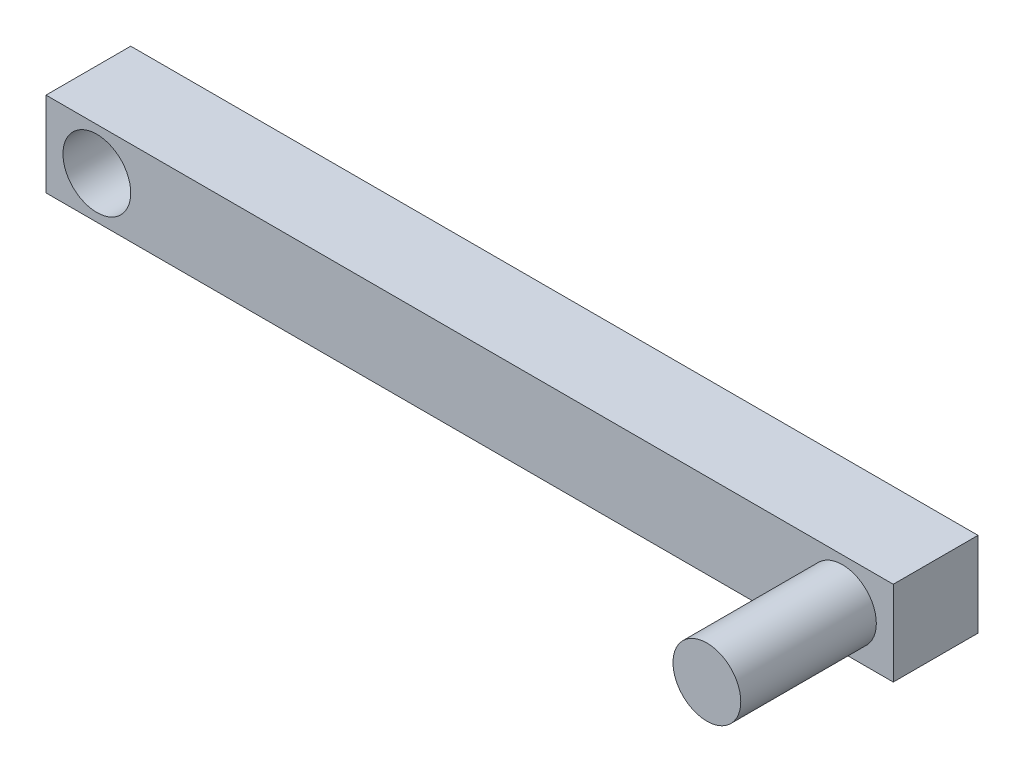
ISO-10303-21;
HEADER;
FILE_DESCRIPTION(('STEP AP214'),'2;1');
FILE_NAME('part.step','',(''),(''),'','','');
FILE_SCHEMA(('AUTOMOTIVE_DESIGN { 1 0 10303 214 1 1 1 1 }'));
ENDSEC;
DATA;
#1=APPLICATION_CONTEXT('core data for automotive mechanical design processes');
#2=APPLICATION_PROTOCOL_DEFINITION('international standard','automotive_design',2000,#1);
#3=PRODUCT_CONTEXT('',#1,'mechanical');
#4=PRODUCT('Part','Part','',(#3));
#5=PRODUCT_RELATED_PRODUCT_CATEGORY('part','',(#4));
#6=PRODUCT_DEFINITION_FORMATION('','',#4);
#7=PRODUCT_DEFINITION_CONTEXT('part definition',#1,'design');
#8=PRODUCT_DEFINITION('design','',#6,#7);
#9=PRODUCT_DEFINITION_SHAPE('','',#8);
#10=(LENGTH_UNIT() NAMED_UNIT(*) SI_UNIT(.MILLI.,.METRE.));
#11=(NAMED_UNIT(*) PLANE_ANGLE_UNIT() SI_UNIT($,.RADIAN.));
#12=(NAMED_UNIT(*) SI_UNIT($,.STERADIAN.) SOLID_ANGLE_UNIT());
#13=UNCERTAINTY_MEASURE_WITH_UNIT(LENGTH_MEASURE(1.E-05),#10,'distance_accuracy_value','');
#14=(GEOMETRIC_REPRESENTATION_CONTEXT(3) GLOBAL_UNCERTAINTY_ASSIGNED_CONTEXT((#13)) GLOBAL_UNIT_ASSIGNED_CONTEXT((#10,
#11,#12)) REPRESENTATION_CONTEXT('',''));
#15=CARTESIAN_POINT('',(0.,0.,0.));
#16=DIRECTION('',(0.,0.,1.));
#17=DIRECTION('',(1.,0.,0.));
#18=AXIS2_PLACEMENT_3D('',#15,#16,#17);
#19=CARTESIAN_POINT('',(-41.0400000000001,5.,5.));
#20=DIRECTION('',(1.,0.,0.));
#21=DIRECTION('',(0.,0.,-1.));
#22=AXIS2_PLACEMENT_3D('',#19,#20,#21);
#23=PLANE('',#22);
#24=DIRECTION('',(0.,-1.,0.));
#25=VECTOR('',#24,1.);
#26=CARTESIAN_POINT('',(-41.0400000000001,5.,0.));
#27=LINE('',#26,#25);
#28=CARTESIAN_POINT('',(-41.0400000000001,5.,0.));
#29=VERTEX_POINT('',#28);
#30=CARTESIAN_POINT('',(-41.0400000000001,0.,0.));
#31=VERTEX_POINT('',#30);
#32=EDGE_CURVE('E107',#29,#31,#27,.T.);
#33=ORIENTED_EDGE('',*,*,#32,.T.);
#34=DIRECTION('',(0.,0.,-1.));
#35=VECTOR('',#34,1.);
#36=CARTESIAN_POINT('',(-41.0400000000001,0.,5.));
#37=LINE('',#36,#35);
#38=CARTESIAN_POINT('',(-41.0400000000001,0.,5.));
#39=VERTEX_POINT('',#38);
#40=EDGE_CURVE('E11',#39,#31,#37,.T.);
#41=ORIENTED_EDGE('',*,*,#40,.F.);
#42=DIRECTION('',(0.,-1.,0.));
#43=VECTOR('',#42,1.);
#44=CARTESIAN_POINT('',(-41.0400000000001,5.,5.));
#45=LINE('',#44,#43);
#46=CARTESIAN_POINT('',(-41.0400000000001,5.,5.));
#47=VERTEX_POINT('',#46);
#48=EDGE_CURVE('E91',#47,#39,#45,.T.);
#49=ORIENTED_EDGE('',*,*,#48,.F.);
#50=DIRECTION('',(0.,0.,-1.));
#51=VECTOR('',#50,1.);
#52=CARTESIAN_POINT('',(-41.0400000000001,5.,5.));
#53=LINE('',#52,#51);
#54=EDGE_CURVE('E103',#47,#29,#53,.T.);
#55=ORIENTED_EDGE('',*,*,#54,.T.);
#56=EDGE_LOOP('',(#33,#41,#49,#55));
#57=FACE_BOUND('',#56,.T.);
#58=ADVANCED_FACE('F39',(#57),#23,.F.);
#59=CARTESIAN_POINT('',(-41.0400000000001,0.,5.));
#60=DIRECTION('',(0.,1.,0.));
#61=DIRECTION('',(0.,0.,1.));
#62=AXIS2_PLACEMENT_3D('',#59,#60,#61);
#63=PLANE('',#62);
#64=DIRECTION('',(1.,0.,0.));
#65=VECTOR('',#64,1.);
#66=CARTESIAN_POINT('',(-41.0400000000001,0.,0.));
#67=LINE('',#66,#65);
#68=CARTESIAN_POINT('',(8.95999999999995,0.,0.));
#69=VERTEX_POINT('',#68);
#70=EDGE_CURVE('E96',#31,#69,#67,.T.);
#71=ORIENTED_EDGE('',*,*,#70,.T.);
#72=DIRECTION('',(0.,0.,-1.));
#73=VECTOR('',#72,1.);
#74=CARTESIAN_POINT('',(8.95999999999995,0.,5.));
#75=LINE('',#74,#73);
#76=CARTESIAN_POINT('',(8.95999999999995,0.,5.));
#77=VERTEX_POINT('',#76);
#78=EDGE_CURVE('E48',#77,#69,#75,.T.);
#79=ORIENTED_EDGE('',*,*,#78,.F.);
#80=DIRECTION('',(1.,0.,0.));
#81=VECTOR('',#80,1.);
#82=CARTESIAN_POINT('',(-41.0400000000001,0.,5.));
#83=LINE('',#82,#81);
#84=EDGE_CURVE('E86',#39,#77,#83,.T.);
#85=ORIENTED_EDGE('',*,*,#84,.F.);
#86=ORIENTED_EDGE('',*,*,#40,.T.);
#87=EDGE_LOOP('',(#71,#79,#85,#86));
#88=FACE_BOUND('',#87,.T.);
#89=ADVANCED_FACE('F95',(#88),#63,.F.);
#90=CARTESIAN_POINT('',(8.95999999999995,5.,5.));
#91=DIRECTION('',(-1.,0.,0.));
#92=DIRECTION('',(0.,0.,1.));
#93=AXIS2_PLACEMENT_3D('',#90,#91,#92);
#94=PLANE('',#93);
#95=DIRECTION('',(0.,1.,0.));
#96=VECTOR('',#95,1.);
#97=CARTESIAN_POINT('',(8.95999999999995,5.,0.));
#98=LINE('',#97,#96);
#99=CARTESIAN_POINT('',(8.95999999999995,5.,0.));
#100=VERTEX_POINT('',#99);
#101=EDGE_CURVE('E73',#69,#100,#98,.T.);
#102=ORIENTED_EDGE('',*,*,#101,.T.);
#103=DIRECTION('',(0.,0.,-1.));
#104=VECTOR('',#103,1.);
#105=CARTESIAN_POINT('',(8.95999999999995,5.,5.));
#106=LINE('',#105,#104);
#107=CARTESIAN_POINT('',(8.95999999999995,5.,5.));
#108=VERTEX_POINT('',#107);
#109=EDGE_CURVE('E98',#108,#100,#106,.T.);
#110=ORIENTED_EDGE('',*,*,#109,.F.);
#111=DIRECTION('',(0.,1.,0.));
#112=VECTOR('',#111,1.);
#113=CARTESIAN_POINT('',(8.95999999999995,5.,5.));
#114=LINE('',#113,#112);
#115=EDGE_CURVE('E89',#77,#108,#114,.T.);
#116=ORIENTED_EDGE('',*,*,#115,.F.);
#117=ORIENTED_EDGE('',*,*,#78,.T.);
#118=EDGE_LOOP('',(#102,#110,#116,#117));
#119=FACE_BOUND('',#118,.T.);
#120=ADVANCED_FACE('F99',(#119),#94,.F.);
#121=CARTESIAN_POINT('',(-41.0400000000001,5.,5.));
#122=DIRECTION('',(0.,-1.,0.));
#123=DIRECTION('',(1.,0.,0.));
#124=AXIS2_PLACEMENT_3D('',#121,#122,#123);
#125=PLANE('',#124);
#126=DIRECTION('',(-1.,0.,0.));
#127=VECTOR('',#126,1.);
#128=CARTESIAN_POINT('',(-41.0400000000001,5.,0.));
#129=LINE('',#128,#127);
#130=EDGE_CURVE('E79',#100,#29,#129,.T.);
#131=ORIENTED_EDGE('',*,*,#130,.T.);
#132=ORIENTED_EDGE('',*,*,#54,.F.);
#133=DIRECTION('',(-1.,0.,0.));
#134=VECTOR('',#133,1.);
#135=CARTESIAN_POINT('',(-41.0400000000001,5.,5.));
#136=LINE('',#135,#134);
#137=EDGE_CURVE('E56',#108,#47,#136,.T.);
#138=ORIENTED_EDGE('',*,*,#137,.F.);
#139=ORIENTED_EDGE('',*,*,#109,.T.);
#140=EDGE_LOOP('',(#131,#132,#138,#139));
#141=FACE_BOUND('',#140,.T.);
#142=ADVANCED_FACE('F121',(#141),#125,.F.);
#143=CARTESIAN_POINT('',(0.,0.,5.));
#144=DIRECTION('',(0.,0.,1.));
#145=DIRECTION('',(1.,0.,0.));
#146=AXIS2_PLACEMENT_3D('',#143,#144,#145);
#147=PLANE('',#146);
#148=CARTESIAN_POINT('',(5.95999999999995,2.5,5.));
#149=DIRECTION('',(0.,0.,1.));
#150=DIRECTION('',(1.,0.,0.));
#151=AXIS2_PLACEMENT_3D('',#148,#149,#150);
#152=CIRCLE('',#151,2.);
#153=CARTESIAN_POINT('',(7.95999999999995,2.5,5.));
#154=VERTEX_POINT('',#153);
#155=EDGE_CURVE('E136',#154,#154,#152,.T.);
#156=ORIENTED_EDGE('',*,*,#155,.F.);
#157=EDGE_LOOP('',(#156));
#158=FACE_BOUND('',#157,.T.);
#159=CARTESIAN_POINT('',(-38.0400000000001,2.5,5.));
#160=DIRECTION('',(0.,0.,1.));
#161=DIRECTION('',(1.,0.,0.));
#162=AXIS2_PLACEMENT_3D('',#159,#160,#161);
#163=CIRCLE('',#162,2.);
#164=CARTESIAN_POINT('',(-36.04,2.5,5.));
#165=VERTEX_POINT('',#164);
#166=EDGE_CURVE('E128',#165,#165,#163,.T.);
#167=ORIENTED_EDGE('',*,*,#166,.F.);
#168=EDGE_LOOP('',(#167));
#169=FACE_BOUND('',#168,.T.);
#170=ORIENTED_EDGE('',*,*,#48,.T.);
#171=ORIENTED_EDGE('',*,*,#84,.T.);
#172=ORIENTED_EDGE('',*,*,#115,.T.);
#173=ORIENTED_EDGE('',*,*,#137,.T.);
#174=EDGE_LOOP('',(#170,#171,#172,#173));
#175=FACE_BOUND('',#174,.T.);
#176=ADVANCED_FACE('F87',(#158,#169,#175),#147,.T.);
#177=CARTESIAN_POINT('',(0.,0.,0.));
#178=DIRECTION('',(0.,0.,1.));
#179=DIRECTION('',(1.,0.,0.));
#180=AXIS2_PLACEMENT_3D('',#177,#178,#179);
#181=PLANE('',#180);
#182=CARTESIAN_POINT('',(-38.0400000000001,2.5,0.));
#183=DIRECTION('',(0.,0.,1.));
#184=DIRECTION('',(1.,0.,0.));
#185=AXIS2_PLACEMENT_3D('',#182,#183,#184);
#186=CIRCLE('',#185,2.);
#187=CARTESIAN_POINT('',(-36.04,2.5,0.));
#188=VERTEX_POINT('',#187);
#189=EDGE_CURVE('E111',#188,#188,#186,.T.);
#190=ORIENTED_EDGE('',*,*,#189,.T.);
#191=EDGE_LOOP('',(#190));
#192=FACE_BOUND('',#191,.T.);
#193=ORIENTED_EDGE('',*,*,#32,.F.);
#194=ORIENTED_EDGE('',*,*,#130,.F.);
#195=ORIENTED_EDGE('',*,*,#101,.F.);
#196=ORIENTED_EDGE('',*,*,#70,.F.);
#197=EDGE_LOOP('',(#193,#194,#195,#196));
#198=FACE_BOUND('',#197,.T.);
#199=ADVANCED_FACE('F124',(#192,#198),#181,.F.);
#200=CARTESIAN_POINT('',(-38.0400000000001,2.5,0.));
#201=DIRECTION('',(0.,0.,1.));
#202=DIRECTION('',(1.,0.,0.));
#203=AXIS2_PLACEMENT_3D('',#200,#201,#202);
#204=CYLINDRICAL_SURFACE('',#203,2.);
#205=ORIENTED_EDGE('',*,*,#189,.F.);
#206=EDGE_LOOP('',(#205));
#207=FACE_BOUND('',#206,.T.);
#208=ORIENTED_EDGE('',*,*,#166,.T.);
#209=EDGE_LOOP('',(#208));
#210=FACE_BOUND('',#209,.T.);
#211=ADVANCED_FACE('F149',(#207,#210),#204,.F.);
#212=CARTESIAN_POINT('',(5.95999999999995,2.5,13.));
#213=DIRECTION('',(0.,0.,-1.));
#214=DIRECTION('',(-1.,0.,0.));
#215=AXIS2_PLACEMENT_3D('',#212,#213,#214);
#216=CYLINDRICAL_SURFACE('',#215,2.);
#217=CARTESIAN_POINT('',(5.95999999999995,2.5,13.));
#218=DIRECTION('',(0.,0.,1.));
#219=DIRECTION('',(1.,0.,0.));
#220=AXIS2_PLACEMENT_3D('',#217,#218,#219);
#221=CIRCLE('',#220,2.);
#222=CARTESIAN_POINT('',(7.95999999999995,2.5,13.));
#223=VERTEX_POINT('',#222);
#224=EDGE_CURVE('E132',#223,#223,#221,.T.);
#225=ORIENTED_EDGE('',*,*,#224,.F.);
#226=EDGE_LOOP('',(#225));
#227=FACE_BOUND('',#226,.T.);
#228=ORIENTED_EDGE('',*,*,#155,.T.);
#229=EDGE_LOOP('',(#228));
#230=FACE_BOUND('',#229,.T.);
#231=ADVANCED_FACE('F146',(#227,#230),#216,.T.);
#232=CARTESIAN_POINT('',(5.95999999999995,2.5,13.));
#233=DIRECTION('',(0.,0.,1.));
#234=DIRECTION('',(1.,0.,0.));
#235=AXIS2_PLACEMENT_3D('',#232,#233,#234);
#236=PLANE('',#235);
#237=ORIENTED_EDGE('',*,*,#224,.T.);
#238=EDGE_LOOP('',(#237));
#239=FACE_BOUND('',#238,.T.);
#240=ADVANCED_FACE('F144',(#239),#236,.T.);
#241=CLOSED_SHELL('',(#58,#89,#120,#142,#176,#199,#211,#231,#240));
#242=MANIFOLD_SOLID_BREP('B2',#241);
#243=ADVANCED_BREP_SHAPE_REPRESENTATION('',(#18,#242),#14);
#244=SHAPE_DEFINITION_REPRESENTATION(#9,#243);
ENDSEC;
END-ISO-10303-21;
